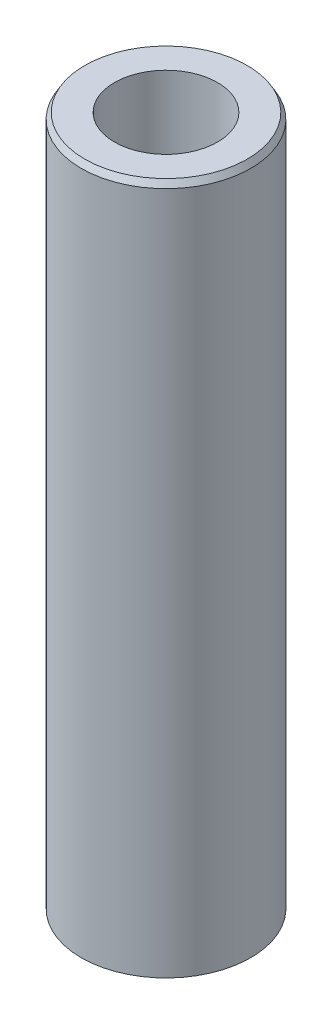
ISO-10303-21;
HEADER;
FILE_DESCRIPTION(('STEP AP214'),'2;1');
FILE_NAME('part.step','',(''),(''),'','','');
FILE_SCHEMA(('AUTOMOTIVE_DESIGN { 1 0 10303 214 1 1 1 1 }'));
ENDSEC;
DATA;
#1=APPLICATION_CONTEXT('core data for automotive mechanical design processes');
#2=APPLICATION_PROTOCOL_DEFINITION('international standard','automotive_design',2000,#1);
#3=PRODUCT_CONTEXT('',#1,'mechanical');
#4=PRODUCT('Part','Part','',(#3));
#5=PRODUCT_RELATED_PRODUCT_CATEGORY('part','',(#4));
#6=PRODUCT_DEFINITION_FORMATION('','',#4);
#7=PRODUCT_DEFINITION_CONTEXT('part definition',#1,'design');
#8=PRODUCT_DEFINITION('design','',#6,#7);
#9=PRODUCT_DEFINITION_SHAPE('','',#8);
#10=(LENGTH_UNIT() NAMED_UNIT(*) SI_UNIT(.MILLI.,.METRE.));
#11=(NAMED_UNIT(*) PLANE_ANGLE_UNIT() SI_UNIT($,.RADIAN.));
#12=(NAMED_UNIT(*) SI_UNIT($,.STERADIAN.) SOLID_ANGLE_UNIT());
#13=UNCERTAINTY_MEASURE_WITH_UNIT(LENGTH_MEASURE(1.E-05),#10,'distance_accuracy_value','');
#14=(GEOMETRIC_REPRESENTATION_CONTEXT(3) GLOBAL_UNCERTAINTY_ASSIGNED_CONTEXT((#13)) GLOBAL_UNIT_ASSIGNED_CONTEXT((#10,
#11,#12)) REPRESENTATION_CONTEXT('',''));
#15=CARTESIAN_POINT('',(0.,0.,0.));
#16=DIRECTION('',(0.,0.,1.));
#17=DIRECTION('',(1.,0.,0.));
#18=AXIS2_PLACEMENT_3D('',#15,#16,#17);
#19=CARTESIAN_POINT('',(0.,286.220203176286,0.));
#20=DIRECTION('',(0.,-1.,0.));
#21=DIRECTION('',(0.,0.,-1.));
#22=AXIS2_PLACEMENT_3D('',#19,#20,#21);
#23=CYLINDRICAL_SURFACE('',#22,35.);
#24=CARTESIAN_POINT('',(0.,283.658822344864,0.));
#25=DIRECTION('',(0.,1.,0.));
#26=DIRECTION('',(0.,0.,1.));
#27=AXIS2_PLACEMENT_3D('',#24,#25,#26);
#28=CIRCLE('',#27,35.);
#29=CARTESIAN_POINT('',(0.,283.658822344864,35.));
#30=VERTEX_POINT('',#29);
#31=EDGE_CURVE('E50',#30,#30,#28,.F.);
#32=ORIENTED_EDGE('',*,*,#31,.T.);
#33=EDGE_LOOP('',(#32));
#34=FACE_BOUND('',#33,.T.);
#35=CARTESIAN_POINT('',(0.,1.47881391251847,0.));
#36=DIRECTION('',(0.,1.,0.));
#37=DIRECTION('',(0.,0.,1.));
#38=AXIS2_PLACEMENT_3D('',#35,#36,#37);
#39=CIRCLE('',#38,35.);
#40=CARTESIAN_POINT('',(0.,1.47881391251847,35.));
#41=VERTEX_POINT('',#40);
#42=EDGE_CURVE('E51',#41,#41,#39,.T.);
#43=ORIENTED_EDGE('',*,*,#42,.T.);
#44=EDGE_LOOP('',(#43));
#45=FACE_BOUND('',#44,.T.);
#46=ADVANCED_FACE('F39',(#34,#45),#23,.T.);
#47=CARTESIAN_POINT('',(0.,286.220203176286,0.));
#48=DIRECTION('',(0.,1.,0.));
#49=DIRECTION('',(0.,0.,1.));
#50=AXIS2_PLACEMENT_3D('',#47,#48,#49);
#51=PLANE('',#50);
#52=CARTESIAN_POINT('',(0.,286.220203176286,0.));
#53=DIRECTION('',(0.,1.,0.));
#54=DIRECTION('',(0.,0.,1.));
#55=AXIS2_PLACEMENT_3D('',#52,#53,#54);
#56=CIRCLE('',#55,33.5211860874814);
#57=CARTESIAN_POINT('',(0.,286.220203176286,33.5211860874814));
#58=VERTEX_POINT('',#57);
#59=EDGE_CURVE('E54',#58,#58,#56,.T.);
#60=ORIENTED_EDGE('',*,*,#59,.T.);
#61=EDGE_LOOP('',(#60));
#62=FACE_BOUND('',#61,.T.);
#63=CARTESIAN_POINT('',(0.,286.220203176286,0.));
#64=DIRECTION('',(0.,1.,0.));
#65=DIRECTION('',(0.,0.,1.));
#66=AXIS2_PLACEMENT_3D('',#63,#64,#65);
#67=CIRCLE('',#66,21.2831530905671);
#68=CARTESIAN_POINT('',(0.,286.220203176286,21.2831530905671));
#69=VERTEX_POINT('',#68);
#70=EDGE_CURVE('E58',#69,#69,#67,.T.);
#71=ORIENTED_EDGE('',*,*,#70,.F.);
#72=EDGE_LOOP('',(#71));
#73=FACE_BOUND('',#72,.T.);
#74=ADVANCED_FACE('F69',(#62,#73),#51,.T.);
#75=CARTESIAN_POINT('',(0.,0.,0.));
#76=DIRECTION('',(0.,1.,0.));
#77=DIRECTION('',(0.,0.,1.));
#78=AXIS2_PLACEMENT_3D('',#75,#76,#77);
#79=PLANE('',#78);
#80=CARTESIAN_POINT('',(0.,0.,0.));
#81=DIRECTION('',(0.,1.,0.));
#82=DIRECTION('',(0.,0.,1.));
#83=AXIS2_PLACEMENT_3D('',#80,#81,#82);
#84=CIRCLE('',#83,32.4386191685783);
#85=CARTESIAN_POINT('',(0.,0.,32.4386191685783));
#86=VERTEX_POINT('',#85);
#87=EDGE_CURVE('E10',#86,#86,#84,.F.);
#88=ORIENTED_EDGE('',*,*,#87,.T.);
#89=EDGE_LOOP('',(#88));
#90=FACE_BOUND('',#89,.T.);
#91=CARTESIAN_POINT('',(0.,0.,0.));
#92=DIRECTION('',(0.,1.,0.));
#93=DIRECTION('',(0.,0.,1.));
#94=AXIS2_PLACEMENT_3D('',#91,#92,#93);
#95=CIRCLE('',#94,21.2831530905671);
#96=CARTESIAN_POINT('',(0.,0.,21.2831530905671));
#97=VERTEX_POINT('',#96);
#98=EDGE_CURVE('E63',#97,#97,#95,.T.);
#99=ORIENTED_EDGE('',*,*,#98,.T.);
#100=EDGE_LOOP('',(#99));
#101=FACE_BOUND('',#100,.T.);
#102=ADVANCED_FACE('F75',(#90,#101),#79,.F.);
#103=CARTESIAN_POINT('',(0.,286.220203176286,0.));
#104=DIRECTION('',(0.,-1.,0.));
#105=DIRECTION('',(0.,0.,-1.));
#106=AXIS2_PLACEMENT_3D('',#103,#104,#105);
#107=CYLINDRICAL_SURFACE('',#106,21.2831530905671);
#108=ORIENTED_EDGE('',*,*,#70,.T.);
#109=EDGE_LOOP('',(#108));
#110=FACE_BOUND('',#109,.T.);
#111=ORIENTED_EDGE('',*,*,#98,.F.);
#112=EDGE_LOOP('',(#111));
#113=FACE_BOUND('',#112,.T.);
#114=ADVANCED_FACE('F70',(#110,#113),#107,.F.);
#115=CARTESIAN_POINT('',(0.,286.220203176286,0.));
#116=DIRECTION('',(0.,-1.,0.));
#117=DIRECTION('',(0.,0.,-1.));
#118=AXIS2_PLACEMENT_3D('',#115,#116,#117);
#119=CONICAL_SURFACE('',#118,33.5211860874814,0.523598775598297);
#120=ORIENTED_EDGE('',*,*,#31,.F.);
#121=EDGE_LOOP('',(#120));
#122=FACE_BOUND('',#121,.T.);
#123=ORIENTED_EDGE('',*,*,#59,.F.);
#124=EDGE_LOOP('',(#123));
#125=FACE_BOUND('',#124,.T.);
#126=ADVANCED_FACE('F81',(#122,#125),#119,.T.);
#127=CARTESIAN_POINT('',(0.,1.47881391251847,0.));
#128=DIRECTION('',(0.,1.,0.));
#129=DIRECTION('',(0.,0.,1.));
#130=AXIS2_PLACEMENT_3D('',#127,#128,#129);
#131=CONICAL_SURFACE('',#130,35.,1.0471975511966);
#132=ORIENTED_EDGE('',*,*,#87,.F.);
#133=EDGE_LOOP('',(#132));
#134=FACE_BOUND('',#133,.T.);
#135=ORIENTED_EDGE('',*,*,#42,.F.);
#136=EDGE_LOOP('',(#135));
#137=FACE_BOUND('',#136,.T.);
#138=ADVANCED_FACE('F45',(#134,#137),#131,.T.);
#139=CLOSED_SHELL('',(#46,#74,#102,#114,#126,#138));
#140=MANIFOLD_SOLID_BREP('B2',#139);
#141=ADVANCED_BREP_SHAPE_REPRESENTATION('',(#18,#140),#14);
#142=SHAPE_DEFINITION_REPRESENTATION(#9,#141);
ENDSEC;
END-ISO-10303-21;
